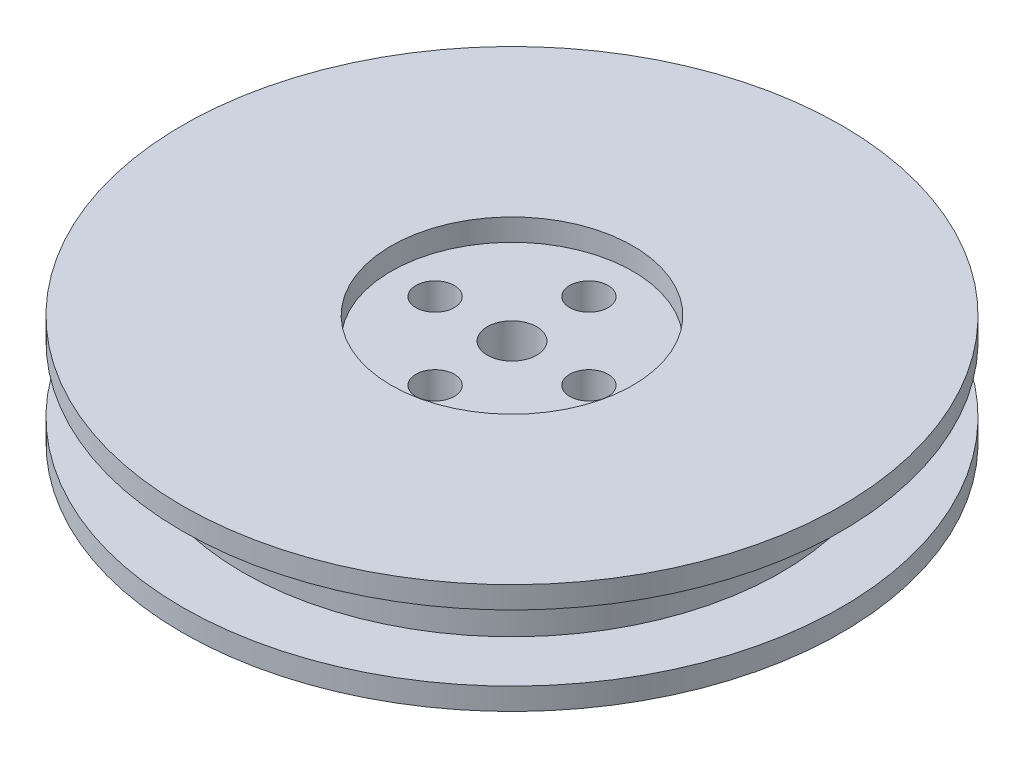
ISO-10303-21;
HEADER;
FILE_DESCRIPTION(('STEP AP214'),'2;1');
FILE_NAME('part.step','',(''),(''),'','','');
FILE_SCHEMA(('AUTOMOTIVE_DESIGN { 1 0 10303 214 1 1 1 1 }'));
ENDSEC;
DATA;
#1=APPLICATION_CONTEXT('core data for automotive mechanical design processes');
#2=APPLICATION_PROTOCOL_DEFINITION('international standard','automotive_design',2000,#1);
#3=PRODUCT_CONTEXT('',#1,'mechanical');
#4=PRODUCT('Part','Part','',(#3));
#5=PRODUCT_RELATED_PRODUCT_CATEGORY('part','',(#4));
#6=PRODUCT_DEFINITION_FORMATION('','',#4);
#7=PRODUCT_DEFINITION_CONTEXT('part definition',#1,'design');
#8=PRODUCT_DEFINITION('design','',#6,#7);
#9=PRODUCT_DEFINITION_SHAPE('','',#8);
#10=(LENGTH_UNIT() NAMED_UNIT(*) SI_UNIT(.MILLI.,.METRE.));
#11=(NAMED_UNIT(*) PLANE_ANGLE_UNIT() SI_UNIT($,.RADIAN.));
#12=(NAMED_UNIT(*) SI_UNIT($,.STERADIAN.) SOLID_ANGLE_UNIT());
#13=UNCERTAINTY_MEASURE_WITH_UNIT(LENGTH_MEASURE(1.E-05),#10,'distance_accuracy_value','');
#14=(GEOMETRIC_REPRESENTATION_CONTEXT(3) GLOBAL_UNCERTAINTY_ASSIGNED_CONTEXT((#13)) GLOBAL_UNIT_ASSIGNED_CONTEXT((#10,
#11,#12)) REPRESENTATION_CONTEXT('',''));
#15=CARTESIAN_POINT('',(0.,0.,0.));
#16=DIRECTION('',(0.,0.,1.));
#17=DIRECTION('',(1.,0.,0.));
#18=AXIS2_PLACEMENT_3D('',#15,#16,#17);
#19=CARTESIAN_POINT('',(0.,-17.,0.));
#20=DIRECTION('',(0.,1.,0.));
#21=DIRECTION('',(0.,0.,1.));
#22=AXIS2_PLACEMENT_3D('',#19,#20,#21);
#23=CYLINDRICAL_SURFACE('',#22,2.25);
#24=CARTESIAN_POINT('',(0.,8.,0.));
#25=DIRECTION('',(0.,1.,0.));
#26=DIRECTION('',(0.,0.,1.));
#27=AXIS2_PLACEMENT_3D('',#24,#25,#26);
#28=CIRCLE('',#27,2.25);
#29=CARTESIAN_POINT('',(0.,8.,2.25));
#30=VERTEX_POINT('',#29);
#31=EDGE_CURVE('E67',#30,#30,#28,.T.);
#32=ORIENTED_EDGE('',*,*,#31,.T.);
#33=EDGE_LOOP('',(#32));
#34=FACE_BOUND('',#33,.T.);
#35=CARTESIAN_POINT('',(0.,2.,0.));
#36=DIRECTION('',(0.,-1.,0.));
#37=DIRECTION('',(0.,0.,-1.));
#38=AXIS2_PLACEMENT_3D('',#35,#36,#37);
#39=CIRCLE('',#38,2.25);
#40=CARTESIAN_POINT('',(0.,2.,-2.25));
#41=VERTEX_POINT('',#40);
#42=EDGE_CURVE('E77',#41,#41,#39,.F.);
#43=ORIENTED_EDGE('',*,*,#42,.F.);
#44=EDGE_LOOP('',(#43));
#45=FACE_BOUND('',#44,.T.);
#46=ADVANCED_FACE('F31',(#34,#45),#23,.F.);
#47=CARTESIAN_POINT('',(-6.9999999999998,-19.,1.98951966012828E-13));
#48=DIRECTION('',(0.,1.,0.));
#49=DIRECTION('',(0.,0.,1.));
#50=AXIS2_PLACEMENT_3D('',#47,#48,#49);
#51=CYLINDRICAL_SURFACE('',#50,1.75000000000032);
#52=CARTESIAN_POINT('',(-6.9999999999998,8.,1.98951966012828E-13));
#53=DIRECTION('',(0.,1.,0.));
#54=DIRECTION('',(0.,0.,1.));
#55=AXIS2_PLACEMENT_3D('',#52,#53,#54);
#56=CIRCLE('',#55,1.75000000000032);
#57=CARTESIAN_POINT('',(-6.9999999999998,8.,1.75000000000052));
#58=VERTEX_POINT('',#57);
#59=EDGE_CURVE('E73',#58,#58,#56,.T.);
#60=ORIENTED_EDGE('',*,*,#59,.T.);
#61=EDGE_LOOP('',(#60));
#62=FACE_BOUND('',#61,.T.);
#63=CARTESIAN_POINT('',(-6.9999999999998,2.,1.98951966012828E-13));
#64=DIRECTION('',(0.,-1.,0.));
#65=DIRECTION('',(0.,0.,-1.));
#66=AXIS2_PLACEMENT_3D('',#63,#64,#65);
#67=CIRCLE('',#66,1.75000000000032);
#68=CARTESIAN_POINT('',(-6.9999999999998,2.,-1.75000000000012));
#69=VERTEX_POINT('',#68);
#70=EDGE_CURVE('E87',#69,#69,#67,.F.);
#71=ORIENTED_EDGE('',*,*,#70,.F.);
#72=EDGE_LOOP('',(#71));
#73=FACE_BOUND('',#72,.T.);
#74=ADVANCED_FACE('F125',(#62,#73),#51,.F.);
#75=CARTESIAN_POINT('',(3.9618942650685E-13,-19.,7.));
#76=DIRECTION('',(0.,1.,0.));
#77=DIRECTION('',(0.,0.,1.));
#78=AXIS2_PLACEMENT_3D('',#75,#76,#77);
#79=CYLINDRICAL_SURFACE('',#78,1.75000000000043);
#80=CARTESIAN_POINT('',(3.9618942650685E-13,8.,7.));
#81=DIRECTION('',(0.,1.,0.));
#82=DIRECTION('',(0.,0.,1.));
#83=AXIS2_PLACEMENT_3D('',#80,#81,#82);
#84=CIRCLE('',#83,1.75000000000043);
#85=CARTESIAN_POINT('',(3.9618942650685E-13,8.,8.75000000000043));
#86=VERTEX_POINT('',#85);
#87=EDGE_CURVE('E76',#86,#86,#84,.T.);
#88=ORIENTED_EDGE('',*,*,#87,.T.);
#89=EDGE_LOOP('',(#88));
#90=FACE_BOUND('',#89,.T.);
#91=CARTESIAN_POINT('',(3.9618942650685E-13,2.,7.));
#92=DIRECTION('',(0.,-1.,0.));
#93=DIRECTION('',(0.,0.,-1.));
#94=AXIS2_PLACEMENT_3D('',#91,#92,#93);
#95=CIRCLE('',#94,1.75000000000043);
#96=CARTESIAN_POINT('',(3.9618942650685E-13,2.,5.24999999999957));
#97=VERTEX_POINT('',#96);
#98=EDGE_CURVE('E90',#97,#97,#95,.F.);
#99=ORIENTED_EDGE('',*,*,#98,.F.);
#100=EDGE_LOOP('',(#99));
#101=FACE_BOUND('',#100,.T.);
#102=ADVANCED_FACE('F120',(#90,#101),#79,.F.);
#103=CARTESIAN_POINT('',(7.0000000000002,-19.,-1.98094713253425E-13));
#104=DIRECTION('',(0.,1.,0.));
#105=DIRECTION('',(0.,0.,1.));
#106=AXIS2_PLACEMENT_3D('',#103,#104,#105);
#107=CYLINDRICAL_SURFACE('',#106,1.75000000000015);
#108=CARTESIAN_POINT('',(7.0000000000002,8.,-1.98094713253425E-13));
#109=DIRECTION('',(0.,1.,0.));
#110=DIRECTION('',(0.,0.,1.));
#111=AXIS2_PLACEMENT_3D('',#108,#109,#110);
#112=CIRCLE('',#111,1.75000000000015);
#113=CARTESIAN_POINT('',(7.0000000000002,8.,1.74999999999996));
#114=VERTEX_POINT('',#113);
#115=EDGE_CURVE('E80',#114,#114,#112,.T.);
#116=ORIENTED_EDGE('',*,*,#115,.T.);
#117=EDGE_LOOP('',(#116));
#118=FACE_BOUND('',#117,.T.);
#119=CARTESIAN_POINT('',(7.0000000000002,2.,-1.98094713253425E-13));
#120=DIRECTION('',(0.,-1.,0.));
#121=DIRECTION('',(0.,0.,-1.));
#122=AXIS2_PLACEMENT_3D('',#119,#120,#121);
#123=CIRCLE('',#122,1.75000000000015);
#124=CARTESIAN_POINT('',(7.0000000000002,2.,-1.75000000000035));
#125=VERTEX_POINT('',#124);
#126=EDGE_CURVE('E93',#125,#125,#123,.F.);
#127=ORIENTED_EDGE('',*,*,#126,.F.);
#128=EDGE_LOOP('',(#127));
#129=FACE_BOUND('',#128,.T.);
#130=ADVANCED_FACE('F111',(#118,#129),#107,.F.);
#131=CARTESIAN_POINT('',(0.,-19.,-7.));
#132=DIRECTION('',(0.,1.,0.));
#133=DIRECTION('',(0.,0.,1.));
#134=AXIS2_PLACEMENT_3D('',#131,#132,#133);
#135=CYLINDRICAL_SURFACE('',#134,1.75);
#136=CARTESIAN_POINT('',(0.,8.,-7.));
#137=DIRECTION('',(0.,1.,0.));
#138=DIRECTION('',(0.,0.,1.));
#139=AXIS2_PLACEMENT_3D('',#136,#137,#138);
#140=CIRCLE('',#139,1.75);
#141=CARTESIAN_POINT('',(0.,8.,-5.25));
#142=VERTEX_POINT('',#141);
#143=EDGE_CURVE('E72',#142,#142,#140,.T.);
#144=ORIENTED_EDGE('',*,*,#143,.T.);
#145=EDGE_LOOP('',(#144));
#146=FACE_BOUND('',#145,.T.);
#147=CARTESIAN_POINT('',(0.,2.,-7.));
#148=DIRECTION('',(0.,-1.,0.));
#149=DIRECTION('',(0.,0.,-1.));
#150=AXIS2_PLACEMENT_3D('',#147,#148,#149);
#151=CIRCLE('',#150,1.75);
#152=CARTESIAN_POINT('',(0.,2.,-8.75));
#153=VERTEX_POINT('',#152);
#154=EDGE_CURVE('E35',#153,#153,#151,.F.);
#155=ORIENTED_EDGE('',*,*,#154,.F.);
#156=EDGE_LOOP('',(#155));
#157=FACE_BOUND('',#156,.T.);
#158=ADVANCED_FACE('F109',(#146,#157),#135,.F.);
#159=CARTESIAN_POINT('',(0.,2.,0.));
#160=DIRECTION('',(0.,-1.,0.));
#161=DIRECTION('',(0.,0.,-1.));
#162=AXIS2_PLACEMENT_3D('',#159,#160,#161);
#163=CYLINDRICAL_SURFACE('',#162,30.);
#164=CARTESIAN_POINT('',(0.,2.,0.));
#165=DIRECTION('',(0.,1.,0.));
#166=DIRECTION('',(0.,0.,1.));
#167=AXIS2_PLACEMENT_3D('',#164,#165,#166);
#168=CIRCLE('',#167,30.);
#169=CARTESIAN_POINT('',(0.,2.,30.));
#170=VERTEX_POINT('',#169);
#171=EDGE_CURVE('E39',#170,#170,#168,.T.);
#172=ORIENTED_EDGE('',*,*,#171,.F.);
#173=EDGE_LOOP('',(#172));
#174=FACE_BOUND('',#173,.T.);
#175=CARTESIAN_POINT('',(0.,0.,0.));
#176=DIRECTION('',(0.,1.,0.));
#177=DIRECTION('',(0.,0.,1.));
#178=AXIS2_PLACEMENT_3D('',#175,#176,#177);
#179=CIRCLE('',#178,30.);
#180=CARTESIAN_POINT('',(0.,0.,30.));
#181=VERTEX_POINT('',#180);
#182=EDGE_CURVE('E44',#181,#181,#179,.T.);
#183=ORIENTED_EDGE('',*,*,#182,.T.);
#184=EDGE_LOOP('',(#183));
#185=FACE_BOUND('',#184,.T.);
#186=ADVANCED_FACE('F33',(#174,#185),#163,.T.);
#187=CARTESIAN_POINT('',(0.,2.,0.));
#188=DIRECTION('',(0.,1.,0.));
#189=DIRECTION('',(0.,0.,1.));
#190=AXIS2_PLACEMENT_3D('',#187,#188,#189);
#191=PLANE('',#190);
#192=CARTESIAN_POINT('',(0.,2.,0.));
#193=DIRECTION('',(0.,1.,0.));
#194=DIRECTION('',(0.,0.,1.));
#195=AXIS2_PLACEMENT_3D('',#192,#193,#194);
#196=CIRCLE('',#195,24.5);
#197=CARTESIAN_POINT('',(0.,2.,24.5));
#198=VERTEX_POINT('',#197);
#199=EDGE_CURVE('E10',#198,#198,#196,.T.);
#200=ORIENTED_EDGE('',*,*,#199,.F.);
#201=EDGE_LOOP('',(#200));
#202=FACE_BOUND('',#201,.T.);
#203=ORIENTED_EDGE('',*,*,#171,.T.);
#204=EDGE_LOOP('',(#203));
#205=FACE_BOUND('',#204,.T.);
#206=ADVANCED_FACE('F118',(#202,#205),#191,.T.);
#207=CARTESIAN_POINT('',(0.,0.,0.));
#208=DIRECTION('',(0.,1.,0.));
#209=DIRECTION('',(0.,0.,1.));
#210=AXIS2_PLACEMENT_3D('',#207,#208,#209);
#211=PLANE('',#210);
#212=CARTESIAN_POINT('',(0.,0.,0.));
#213=DIRECTION('',(0.,-1.,0.));
#214=DIRECTION('',(0.,0.,-1.));
#215=AXIS2_PLACEMENT_3D('',#212,#213,#214);
#216=CIRCLE('',#215,11.);
#217=CARTESIAN_POINT('',(0.,0.,-11.));
#218=VERTEX_POINT('',#217);
#219=EDGE_CURVE('E96',#218,#218,#216,.T.);
#220=ORIENTED_EDGE('',*,*,#219,.F.);
#221=EDGE_LOOP('',(#220));
#222=FACE_BOUND('',#221,.T.);
#223=ORIENTED_EDGE('',*,*,#182,.F.);
#224=EDGE_LOOP('',(#223));
#225=FACE_BOUND('',#224,.T.);
#226=ADVANCED_FACE('F158',(#222,#225),#211,.F.);
#227=CARTESIAN_POINT('',(0.,8.,0.));
#228=DIRECTION('',(0.,-1.,0.));
#229=DIRECTION('',(0.,0.,-1.));
#230=AXIS2_PLACEMENT_3D('',#227,#228,#229);
#231=CYLINDRICAL_SURFACE('',#230,24.5);
#232=CARTESIAN_POINT('',(0.,8.,0.));
#233=DIRECTION('',(0.,1.,0.));
#234=DIRECTION('',(0.,0.,1.));
#235=AXIS2_PLACEMENT_3D('',#232,#233,#234);
#236=CIRCLE('',#235,24.5);
#237=CARTESIAN_POINT('',(0.,8.,24.5));
#238=VERTEX_POINT('',#237);
#239=EDGE_CURVE('E47',#238,#238,#236,.T.);
#240=ORIENTED_EDGE('',*,*,#239,.F.);
#241=EDGE_LOOP('',(#240));
#242=FACE_BOUND('',#241,.T.);
#243=ORIENTED_EDGE('',*,*,#199,.T.);
#244=EDGE_LOOP('',(#243));
#245=FACE_BOUND('',#244,.T.);
#246=ADVANCED_FACE('F154',(#242,#245),#231,.T.);
#247=CARTESIAN_POINT('',(0.,10.,0.));
#248=DIRECTION('',(0.,-1.,0.));
#249=DIRECTION('',(0.,0.,-1.));
#250=AXIS2_PLACEMENT_3D('',#247,#248,#249);
#251=CYLINDRICAL_SURFACE('',#250,30.);
#252=CARTESIAN_POINT('',(0.,10.,0.));
#253=DIRECTION('',(0.,1.,0.));
#254=DIRECTION('',(0.,0.,1.));
#255=AXIS2_PLACEMENT_3D('',#252,#253,#254);
#256=CIRCLE('',#255,30.);
#257=CARTESIAN_POINT('',(0.,10.,30.));
#258=VERTEX_POINT('',#257);
#259=EDGE_CURVE('E53',#258,#258,#256,.T.);
#260=ORIENTED_EDGE('',*,*,#259,.F.);
#261=EDGE_LOOP('',(#260));
#262=FACE_BOUND('',#261,.T.);
#263=CARTESIAN_POINT('',(0.,8.,0.));
#264=DIRECTION('',(0.,1.,0.));
#265=DIRECTION('',(0.,0.,1.));
#266=AXIS2_PLACEMENT_3D('',#263,#264,#265);
#267=CIRCLE('',#266,30.);
#268=CARTESIAN_POINT('',(0.,8.,30.));
#269=VERTEX_POINT('',#268);
#270=EDGE_CURVE('E57',#269,#269,#267,.T.);
#271=ORIENTED_EDGE('',*,*,#270,.T.);
#272=EDGE_LOOP('',(#271));
#273=FACE_BOUND('',#272,.T.);
#274=ADVANCED_FACE('F148',(#262,#273),#251,.T.);
#275=CARTESIAN_POINT('',(0.,10.,0.));
#276=DIRECTION('',(0.,1.,0.));
#277=DIRECTION('',(0.,0.,1.));
#278=AXIS2_PLACEMENT_3D('',#275,#276,#277);
#279=PLANE('',#278);
#280=CARTESIAN_POINT('',(0.,10.,0.));
#281=DIRECTION('',(0.,1.,0.));
#282=DIRECTION('',(0.,0.,1.));
#283=AXIS2_PLACEMENT_3D('',#280,#281,#282);
#284=CIRCLE('',#283,11.);
#285=CARTESIAN_POINT('',(0.,10.,11.));
#286=VERTEX_POINT('',#285);
#287=EDGE_CURVE('E64',#286,#286,#284,.T.);
#288=ORIENTED_EDGE('',*,*,#287,.F.);
#289=EDGE_LOOP('',(#288));
#290=FACE_BOUND('',#289,.T.);
#291=ORIENTED_EDGE('',*,*,#259,.T.);
#292=EDGE_LOOP('',(#291));
#293=FACE_BOUND('',#292,.T.);
#294=ADVANCED_FACE('F145',(#290,#293),#279,.T.);
#295=CARTESIAN_POINT('',(0.,8.,0.));
#296=DIRECTION('',(0.,1.,0.));
#297=DIRECTION('',(0.,0.,1.));
#298=AXIS2_PLACEMENT_3D('',#295,#296,#297);
#299=PLANE('',#298);
#300=ORIENTED_EDGE('',*,*,#239,.T.);
#301=EDGE_LOOP('',(#300));
#302=FACE_BOUND('',#301,.T.);
#303=ORIENTED_EDGE('',*,*,#270,.F.);
#304=EDGE_LOOP('',(#303));
#305=FACE_BOUND('',#304,.T.);
#306=ADVANCED_FACE('F143',(#302,#305),#299,.F.);
#307=CARTESIAN_POINT('',(0.,8.,0.));
#308=DIRECTION('',(0.,1.,0.));
#309=DIRECTION('',(0.,0.,1.));
#310=AXIS2_PLACEMENT_3D('',#307,#308,#309);
#311=CYLINDRICAL_SURFACE('',#310,11.);
#312=CARTESIAN_POINT('',(0.,8.,0.));
#313=DIRECTION('',(0.,1.,0.));
#314=DIRECTION('',(0.,0.,1.));
#315=AXIS2_PLACEMENT_3D('',#312,#313,#314);
#316=CIRCLE('',#315,11.);
#317=CARTESIAN_POINT('',(0.,8.,11.));
#318=VERTEX_POINT('',#317);
#319=EDGE_CURVE('E62',#318,#318,#316,.T.);
#320=ORIENTED_EDGE('',*,*,#319,.F.);
#321=EDGE_LOOP('',(#320));
#322=FACE_BOUND('',#321,.T.);
#323=ORIENTED_EDGE('',*,*,#287,.T.);
#324=EDGE_LOOP('',(#323));
#325=FACE_BOUND('',#324,.T.);
#326=ADVANCED_FACE('F139',(#322,#325),#311,.F.);
#327=CARTESIAN_POINT('',(0.,8.,0.));
#328=DIRECTION('',(0.,1.,0.));
#329=DIRECTION('',(0.,0.,1.));
#330=AXIS2_PLACEMENT_3D('',#327,#328,#329);
#331=PLANE('',#330);
#332=ORIENTED_EDGE('',*,*,#143,.F.);
#333=EDGE_LOOP('',(#332));
#334=FACE_BOUND('',#333,.T.);
#335=ORIENTED_EDGE('',*,*,#115,.F.);
#336=EDGE_LOOP('',(#335));
#337=FACE_BOUND('',#336,.T.);
#338=ORIENTED_EDGE('',*,*,#87,.F.);
#339=EDGE_LOOP('',(#338));
#340=FACE_BOUND('',#339,.T.);
#341=ORIENTED_EDGE('',*,*,#59,.F.);
#342=EDGE_LOOP('',(#341));
#343=FACE_BOUND('',#342,.T.);
#344=ORIENTED_EDGE('',*,*,#31,.F.);
#345=EDGE_LOOP('',(#344));
#346=FACE_BOUND('',#345,.T.);
#347=ORIENTED_EDGE('',*,*,#319,.T.);
#348=EDGE_LOOP('',(#347));
#349=FACE_BOUND('',#348,.T.);
#350=ADVANCED_FACE('F136',(#334,#337,#340,#343,#346,#349),#331,.T.);
#351=CARTESIAN_POINT('',(0.,2.,0.));
#352=DIRECTION('',(0.,-1.,0.));
#353=DIRECTION('',(0.,0.,-1.));
#354=AXIS2_PLACEMENT_3D('',#351,#352,#353);
#355=PLANE('',#354);
#356=CARTESIAN_POINT('',(0.,2.,0.));
#357=DIRECTION('',(0.,-1.,0.));
#358=DIRECTION('',(0.,0.,-1.));
#359=AXIS2_PLACEMENT_3D('',#356,#357,#358);
#360=CIRCLE('',#359,11.);
#361=CARTESIAN_POINT('',(0.,2.,-11.));
#362=VERTEX_POINT('',#361);
#363=EDGE_CURVE('E99',#362,#362,#360,.T.);
#364=ORIENTED_EDGE('',*,*,#363,.T.);
#365=EDGE_LOOP('',(#364));
#366=FACE_BOUND('',#365,.T.);
#367=ORIENTED_EDGE('',*,*,#154,.T.);
#368=EDGE_LOOP('',(#367));
#369=FACE_BOUND('',#368,.T.);
#370=ORIENTED_EDGE('',*,*,#126,.T.);
#371=EDGE_LOOP('',(#370));
#372=FACE_BOUND('',#371,.T.);
#373=ORIENTED_EDGE('',*,*,#98,.T.);
#374=EDGE_LOOP('',(#373));
#375=FACE_BOUND('',#374,.T.);
#376=ORIENTED_EDGE('',*,*,#70,.T.);
#377=EDGE_LOOP('',(#376));
#378=FACE_BOUND('',#377,.T.);
#379=ORIENTED_EDGE('',*,*,#42,.T.);
#380=EDGE_LOOP('',(#379));
#381=FACE_BOUND('',#380,.T.);
#382=ADVANCED_FACE('F106',(#366,#369,#372,#375,#378,#381),#355,.T.);
#383=CARTESIAN_POINT('',(0.,2.,0.));
#384=DIRECTION('',(0.,-1.,0.));
#385=DIRECTION('',(0.,0.,-1.));
#386=AXIS2_PLACEMENT_3D('',#383,#384,#385);
#387=CYLINDRICAL_SURFACE('',#386,11.);
#388=ORIENTED_EDGE('',*,*,#363,.F.);
#389=EDGE_LOOP('',(#388));
#390=FACE_BOUND('',#389,.T.);
#391=ORIENTED_EDGE('',*,*,#219,.T.);
#392=EDGE_LOOP('',(#391));
#393=FACE_BOUND('',#392,.T.);
#394=ADVANCED_FACE('F169',(#390,#393),#387,.F.);
#395=CLOSED_SHELL('',(#46,#74,#102,#130,#158,#186,#206,#226,#246,#274,#294,#306,#326,#350,#382,#394));
#396=MANIFOLD_SOLID_BREP('B2',#395);
#397=ADVANCED_BREP_SHAPE_REPRESENTATION('',(#18,#396),#14);
#398=SHAPE_DEFINITION_REPRESENTATION(#9,#397);
ENDSEC;
END-ISO-10303-21;
